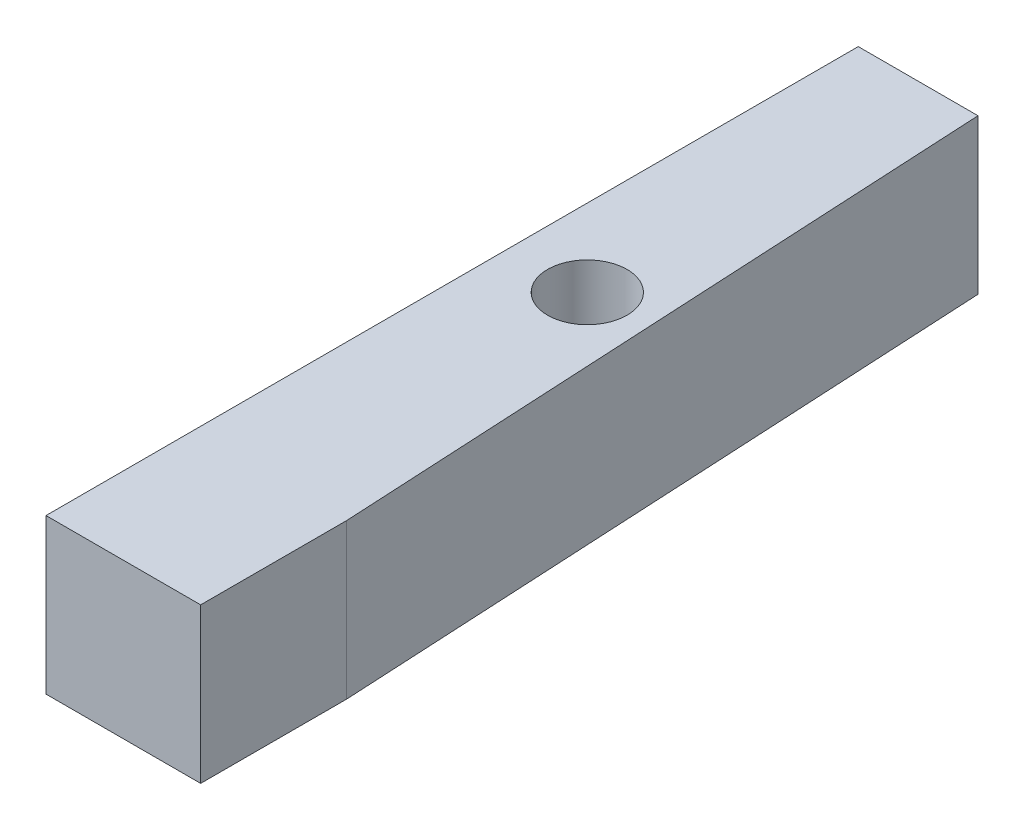
ISO-10303-21;
HEADER;
FILE_DESCRIPTION(('STEP AP214'),'2;1');
FILE_NAME('part.step','',(''),(''),'','','');
FILE_SCHEMA(('AUTOMOTIVE_DESIGN { 1 0 10303 214 1 1 1 1 }'));
ENDSEC;
DATA;
#1=APPLICATION_CONTEXT('core data for automotive mechanical design processes');
#2=APPLICATION_PROTOCOL_DEFINITION('international standard','automotive_design',2000,#1);
#3=PRODUCT_CONTEXT('',#1,'mechanical');
#4=PRODUCT('Part','Part','',(#3));
#5=PRODUCT_RELATED_PRODUCT_CATEGORY('part','',(#4));
#6=PRODUCT_DEFINITION_FORMATION('','',#4);
#7=PRODUCT_DEFINITION_CONTEXT('part definition',#1,'design');
#8=PRODUCT_DEFINITION('design','',#6,#7);
#9=PRODUCT_DEFINITION_SHAPE('','',#8);
#10=(LENGTH_UNIT() NAMED_UNIT(*) SI_UNIT(.MILLI.,.METRE.));
#11=(NAMED_UNIT(*) PLANE_ANGLE_UNIT() SI_UNIT($,.RADIAN.));
#12=(NAMED_UNIT(*) SI_UNIT($,.STERADIAN.) SOLID_ANGLE_UNIT());
#13=UNCERTAINTY_MEASURE_WITH_UNIT(LENGTH_MEASURE(1.E-05),#10,'distance_accuracy_value','');
#14=(GEOMETRIC_REPRESENTATION_CONTEXT(3) GLOBAL_UNCERTAINTY_ASSIGNED_CONTEXT((#13)) GLOBAL_UNIT_ASSIGNED_CONTEXT((#10,
#11,#12)) REPRESENTATION_CONTEXT('',''));
#15=CARTESIAN_POINT('',(0.,0.,0.));
#16=DIRECTION('',(0.,0.,1.));
#17=DIRECTION('',(1.,0.,0.));
#18=AXIS2_PLACEMENT_3D('',#15,#16,#17);
#19=CARTESIAN_POINT('',(12.7,-12.7,-133.4008));
#20=DIRECTION('',(1.,0.,0.));
#21=DIRECTION('',(0.,0.,-1.));
#22=AXIS2_PLACEMENT_3D('',#19,#20,#21);
#23=PLANE('',#22);
#24=DIRECTION('',(0.,1.,0.));
#25=VECTOR('',#24,1.);
#26=CARTESIAN_POINT('',(12.7,-12.7,-23.9783631283085));
#27=LINE('',#26,#25);
#28=CARTESIAN_POINT('',(12.7,-12.7,-23.9783631283085));
#29=VERTEX_POINT('',#28);
#30=CARTESIAN_POINT('',(12.7,12.7,-23.9783631283085));
#31=VERTEX_POINT('',#30);
#32=EDGE_CURVE('E120',#29,#31,#27,.T.);
#33=ORIENTED_EDGE('',*,*,#32,.T.);
#34=DIRECTION('',(0.,0.,1.));
#35=VECTOR('',#34,1.);
#36=CARTESIAN_POINT('',(12.7,12.7,-133.4008));
#37=LINE('',#36,#35);
#38=CARTESIAN_POINT('',(12.7,12.7,0.));
#39=VERTEX_POINT('',#38);
#40=EDGE_CURVE('E36',#31,#39,#37,.T.);
#41=ORIENTED_EDGE('',*,*,#40,.T.);
#42=DIRECTION('',(0.,1.,0.));
#43=VECTOR('',#42,1.);
#44=CARTESIAN_POINT('',(12.7,-12.7,0.));
#45=LINE('',#44,#43);
#46=CARTESIAN_POINT('',(12.7,-12.7,0.));
#47=VERTEX_POINT('',#46);
#48=EDGE_CURVE('E81',#47,#39,#45,.T.);
#49=ORIENTED_EDGE('',*,*,#48,.F.);
#50=DIRECTION('',(0.,0.,1.));
#51=VECTOR('',#50,1.);
#52=CARTESIAN_POINT('',(12.7,-12.7,-133.4008));
#53=LINE('',#52,#51);
#54=EDGE_CURVE('E11',#29,#47,#53,.T.);
#55=ORIENTED_EDGE('',*,*,#54,.F.);
#56=EDGE_LOOP('',(#33,#41,#49,#55));
#57=FACE_BOUND('',#56,.T.);
#58=ADVANCED_FACE('F33',(#57),#23,.T.);
#59=CARTESIAN_POINT('',(-12.7,-12.7,-133.4008));
#60=DIRECTION('',(0.,-1.,0.));
#61=DIRECTION('',(0.,0.,-1.));
#62=AXIS2_PLACEMENT_3D('',#59,#60,#61);
#63=PLANE('',#62);
#64=DIRECTION('',(0.0523359562429443,0.,0.998629534754574));
#65=VECTOR('',#64,1.);
#66=CARTESIAN_POINT('',(13.9184247603265,-12.7,-0.729433732806812));
#67=LINE('',#66,#65);
#68=CARTESIAN_POINT('',(6.96541307981583,-12.7,-133.4008));
#69=VERTEX_POINT('',#68);
#70=EDGE_CURVE('E49',#69,#29,#67,.T.);
#71=ORIENTED_EDGE('',*,*,#70,.T.);
#72=ORIENTED_EDGE('',*,*,#54,.T.);
#73=DIRECTION('',(1.,0.,0.));
#74=VECTOR('',#73,1.);
#75=CARTESIAN_POINT('',(-12.7,-12.7,0.));
#76=LINE('',#75,#74);
#77=CARTESIAN_POINT('',(-12.7,-12.7,0.));
#78=VERTEX_POINT('',#77);
#79=EDGE_CURVE('E77',#78,#47,#76,.T.);
#80=ORIENTED_EDGE('',*,*,#79,.F.);
#81=DIRECTION('',(0.,0.,1.));
#82=VECTOR('',#81,1.);
#83=CARTESIAN_POINT('',(-12.7,-12.7,-133.4008));
#84=LINE('',#83,#82);
#85=CARTESIAN_POINT('',(-12.7,-12.7,-133.4008));
#86=VERTEX_POINT('',#85);
#87=EDGE_CURVE('E41',#86,#78,#84,.T.);
#88=ORIENTED_EDGE('',*,*,#87,.F.);
#89=DIRECTION('',(1.,0.,0.));
#90=VECTOR('',#89,1.);
#91=CARTESIAN_POINT('',(-12.7,-12.7,-133.4008));
#92=LINE('',#91,#90);
#93=EDGE_CURVE('E103',#86,#69,#92,.T.);
#94=ORIENTED_EDGE('',*,*,#93,.T.);
#95=EDGE_LOOP('',(#71,#72,#80,#88,#94));
#96=FACE_BOUND('',#95,.T.);
#97=CARTESIAN_POINT('',(0.,-12.7,-76.2));
#98=DIRECTION('',(0.,1.,0.));
#99=DIRECTION('',(0.,0.,1.));
#100=AXIS2_PLACEMENT_3D('',#97,#98,#99);
#101=CIRCLE('',#100,6.52430187551695);
#102=CARTESIAN_POINT('',(0.,-12.7,-69.6756981244831));
#103=VERTEX_POINT('',#102);
#104=EDGE_CURVE('E87',#103,#103,#101,.T.);
#105=ORIENTED_EDGE('',*,*,#104,.T.);
#106=EDGE_LOOP('',(#105));
#107=FACE_BOUND('',#106,.T.);
#108=ADVANCED_FACE('F74',(#96,#107),#63,.T.);
#109=CARTESIAN_POINT('',(-12.7,-12.7,-133.4008));
#110=DIRECTION('',(-1.,0.,0.));
#111=DIRECTION('',(0.,0.,1.));
#112=AXIS2_PLACEMENT_3D('',#109,#110,#111);
#113=PLANE('',#112);
#114=DIRECTION('',(0.,-1.,0.));
#115=VECTOR('',#114,1.);
#116=CARTESIAN_POINT('',(-12.7,-12.7,0.));
#117=LINE('',#116,#115);
#118=CARTESIAN_POINT('',(-12.7,12.7,0.));
#119=VERTEX_POINT('',#118);
#120=EDGE_CURVE('E92',#119,#78,#117,.T.);
#121=ORIENTED_EDGE('',*,*,#120,.F.);
#122=DIRECTION('',(0.,0.,1.));
#123=VECTOR('',#122,1.);
#124=CARTESIAN_POINT('',(-12.7,12.7,-133.4008));
#125=LINE('',#124,#123);
#126=CARTESIAN_POINT('',(-12.7,12.7,-133.4008));
#127=VERTEX_POINT('',#126);
#128=EDGE_CURVE('E100',#127,#119,#125,.T.);
#129=ORIENTED_EDGE('',*,*,#128,.F.);
#130=DIRECTION('',(0.,-1.,0.));
#131=VECTOR('',#130,1.);
#132=CARTESIAN_POINT('',(-12.7,-12.7,-133.4008));
#133=LINE('',#132,#131);
#134=EDGE_CURVE('E95',#127,#86,#133,.T.);
#135=ORIENTED_EDGE('',*,*,#134,.T.);
#136=ORIENTED_EDGE('',*,*,#87,.T.);
#137=EDGE_LOOP('',(#121,#129,#135,#136));
#138=FACE_BOUND('',#137,.T.);
#139=ADVANCED_FACE('F135',(#138),#113,.T.);
#140=CARTESIAN_POINT('',(-12.7,12.7,-133.4008));
#141=DIRECTION('',(0.,1.,0.));
#142=DIRECTION('',(0.,0.,1.));
#143=AXIS2_PLACEMENT_3D('',#140,#141,#142);
#144=PLANE('',#143);
#145=DIRECTION('',(0.0523359562429443,0.,0.998629534754574));
#146=VECTOR('',#145,1.);
#147=CARTESIAN_POINT('',(13.9184247603265,12.7,-0.729433732806812));
#148=LINE('',#147,#146);
#149=CARTESIAN_POINT('',(6.96541307981583,12.7,-133.4008));
#150=VERTEX_POINT('',#149);
#151=EDGE_CURVE('E113',#150,#31,#148,.T.);
#152=ORIENTED_EDGE('',*,*,#151,.F.);
#153=DIRECTION('',(-1.,0.,0.));
#154=VECTOR('',#153,1.);
#155=CARTESIAN_POINT('',(-12.7,12.7,-133.4008));
#156=LINE('',#155,#154);
#157=EDGE_CURVE('E93',#150,#127,#156,.T.);
#158=ORIENTED_EDGE('',*,*,#157,.T.);
#159=ORIENTED_EDGE('',*,*,#128,.T.);
#160=DIRECTION('',(-1.,0.,0.));
#161=VECTOR('',#160,1.);
#162=CARTESIAN_POINT('',(-12.7,12.7,0.));
#163=LINE('',#162,#161);
#164=EDGE_CURVE('E86',#39,#119,#163,.T.);
#165=ORIENTED_EDGE('',*,*,#164,.F.);
#166=ORIENTED_EDGE('',*,*,#40,.F.);
#167=EDGE_LOOP('',(#152,#158,#159,#165,#166));
#168=FACE_BOUND('',#167,.T.);
#169=CARTESIAN_POINT('',(0.,12.7,-76.2));
#170=DIRECTION('',(0.,1.,0.));
#171=DIRECTION('',(0.,0.,1.));
#172=AXIS2_PLACEMENT_3D('',#169,#170,#171);
#173=CIRCLE('',#172,6.52430187551695);
#174=CARTESIAN_POINT('',(0.,12.7,-69.6756981244831));
#175=VERTEX_POINT('',#174);
#176=EDGE_CURVE('E122',#175,#175,#173,.T.);
#177=ORIENTED_EDGE('',*,*,#176,.F.);
#178=EDGE_LOOP('',(#177));
#179=FACE_BOUND('',#178,.T.);
#180=ADVANCED_FACE('F108',(#168,#179),#144,.T.);
#181=CARTESIAN_POINT('',(0.,0.,-133.4008));
#182=DIRECTION('',(0.,0.,-1.));
#183=DIRECTION('',(-1.,0.,0.));
#184=AXIS2_PLACEMENT_3D('',#181,#182,#183);
#185=PLANE('',#184);
#186=DIRECTION('',(0.,1.,0.));
#187=VECTOR('',#186,1.);
#188=CARTESIAN_POINT('',(6.96541307981583,-12.7,-133.4008));
#189=LINE('',#188,#187);
#190=EDGE_CURVE('E117',#69,#150,#189,.T.);
#191=ORIENTED_EDGE('',*,*,#190,.F.);
#192=ORIENTED_EDGE('',*,*,#93,.F.);
#193=ORIENTED_EDGE('',*,*,#134,.F.);
#194=ORIENTED_EDGE('',*,*,#157,.F.);
#195=EDGE_LOOP('',(#191,#192,#193,#194));
#196=FACE_BOUND('',#195,.T.);
#197=ADVANCED_FACE('F134',(#196),#185,.T.);
#198=CARTESIAN_POINT('',(0.,0.,0.));
#199=DIRECTION('',(0.,0.,-1.));
#200=DIRECTION('',(-1.,0.,0.));
#201=AXIS2_PLACEMENT_3D('',#198,#199,#200);
#202=PLANE('',#201);
#203=ORIENTED_EDGE('',*,*,#48,.T.);
#204=ORIENTED_EDGE('',*,*,#164,.T.);
#205=ORIENTED_EDGE('',*,*,#120,.T.);
#206=ORIENTED_EDGE('',*,*,#79,.T.);
#207=EDGE_LOOP('',(#203,#204,#205,#206));
#208=FACE_BOUND('',#207,.T.);
#209=ADVANCED_FACE('F90',(#208),#202,.F.);
#210=CARTESIAN_POINT('',(0.,-12.7,-76.2));
#211=DIRECTION('',(0.,1.,0.));
#212=DIRECTION('',(0.,0.,1.));
#213=AXIS2_PLACEMENT_3D('',#210,#211,#212);
#214=CYLINDRICAL_SURFACE('',#213,6.52430187551695);
#215=ORIENTED_EDGE('',*,*,#104,.F.);
#216=EDGE_LOOP('',(#215));
#217=FACE_BOUND('',#216,.T.);
#218=ORIENTED_EDGE('',*,*,#176,.T.);
#219=EDGE_LOOP('',(#218));
#220=FACE_BOUND('',#219,.T.);
#221=ADVANCED_FACE('F132',(#217,#220),#214,.F.);
#222=CARTESIAN_POINT('',(13.9184247603265,-12.7,-0.729433732806812));
#223=DIRECTION('',(-0.998629534754574,0.,0.0523359562429443));
#224=DIRECTION('',(0.0523359562429443,0.,0.998629534754574));
#225=AXIS2_PLACEMENT_3D('',#222,#223,#224);
#226=PLANE('',#225);
#227=ORIENTED_EDGE('',*,*,#151,.T.);
#228=ORIENTED_EDGE('',*,*,#32,.F.);
#229=ORIENTED_EDGE('',*,*,#70,.F.);
#230=ORIENTED_EDGE('',*,*,#190,.T.);
#231=EDGE_LOOP('',(#227,#228,#229,#230));
#232=FACE_BOUND('',#231,.T.);
#233=ADVANCED_FACE('F118',(#232),#226,.F.);
#234=CLOSED_SHELL('',(#58,#108,#139,#180,#197,#209,#221,#233));
#235=MANIFOLD_SOLID_BREP('B2',#234);
#236=ADVANCED_BREP_SHAPE_REPRESENTATION('',(#18,#235),#14);
#237=SHAPE_DEFINITION_REPRESENTATION(#9,#236);
ENDSEC;
END-ISO-10303-21;
